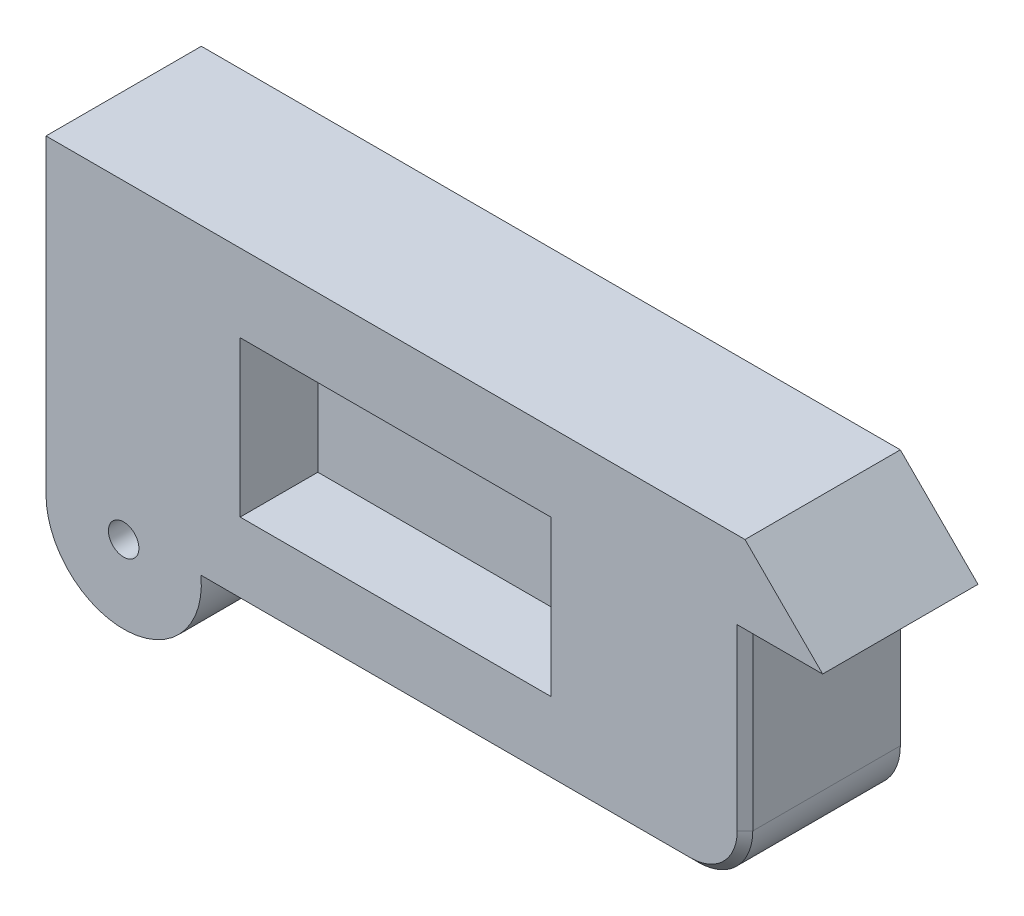
ISO-10303-21;
HEADER;
FILE_DESCRIPTION(('STEP AP214'),'2;1');
FILE_NAME('part.step','',(''),(''),'','','');
FILE_SCHEMA(('AUTOMOTIVE_DESIGN { 1 0 10303 214 1 1 1 1 }'));
ENDSEC;
DATA;
#1=APPLICATION_CONTEXT('core data for automotive mechanical design processes');
#2=APPLICATION_PROTOCOL_DEFINITION('international standard','automotive_design',2000,#1);
#3=PRODUCT_CONTEXT('',#1,'mechanical');
#4=PRODUCT('Part','Part','',(#3));
#5=PRODUCT_RELATED_PRODUCT_CATEGORY('part','',(#4));
#6=PRODUCT_DEFINITION_FORMATION('','',#4);
#7=PRODUCT_DEFINITION_CONTEXT('part definition',#1,'design');
#8=PRODUCT_DEFINITION('design','',#6,#7);
#9=PRODUCT_DEFINITION_SHAPE('','',#8);
#10=(LENGTH_UNIT() NAMED_UNIT(*) SI_UNIT(.MILLI.,.METRE.));
#11=(NAMED_UNIT(*) PLANE_ANGLE_UNIT() SI_UNIT($,.RADIAN.));
#12=(NAMED_UNIT(*) SI_UNIT($,.STERADIAN.) SOLID_ANGLE_UNIT());
#13=UNCERTAINTY_MEASURE_WITH_UNIT(LENGTH_MEASURE(1.E-05),#10,'distance_accuracy_value','');
#14=(GEOMETRIC_REPRESENTATION_CONTEXT(3) GLOBAL_UNCERTAINTY_ASSIGNED_CONTEXT((#13)) GLOBAL_UNIT_ASSIGNED_CONTEXT((#10,
#11,#12)) REPRESENTATION_CONTEXT('',''));
#15=CARTESIAN_POINT('',(0.,0.,0.));
#16=DIRECTION('',(0.,0.,1.));
#17=DIRECTION('',(1.,0.,0.));
#18=AXIS2_PLACEMENT_3D('',#15,#16,#17);
#19=CARTESIAN_POINT('',(254.,0.,508.));
#20=DIRECTION('',(0.,0.,-1.));
#21=DIRECTION('',(-1.,0.,0.));
#22=AXIS2_PLACEMENT_3D('',#19,#20,#21);
#23=CYLINDRICAL_SURFACE('',#22,254.);
#24=CARTESIAN_POINT('',(254.,0.,0.));
#25=DIRECTION('',(0.,0.,1.));
#26=DIRECTION('',(1.,0.,0.));
#27=AXIS2_PLACEMENT_3D('',#24,#25,#26);
#28=CIRCLE('',#27,254.);
#29=CARTESIAN_POINT('',(0.,0.,0.));
#30=VERTEX_POINT('',#29);
#31=CARTESIAN_POINT('',(508.,0.,0.));
#32=VERTEX_POINT('',#31);
#33=EDGE_CURVE('E198',#30,#32,#28,.T.);
#34=ORIENTED_EDGE('',*,*,#33,.T.);
#35=DIRECTION('',(0.,0.,-1.));
#36=VECTOR('',#35,1.);
#37=CARTESIAN_POINT('',(508.,0.,508.));
#38=LINE('',#37,#36);
#39=CARTESIAN_POINT('',(508.,0.,482.6));
#40=VERTEX_POINT('',#39);
#41=EDGE_CURVE('E239',#40,#32,#38,.T.);
#42=ORIENTED_EDGE('',*,*,#41,.F.);
#43=CARTESIAN_POINT('',(254.,0.,482.6));
#44=DIRECTION('',(0.,-0.707106781186548,0.707106781186548));
#45=DIRECTION('',(0.,-0.707106781186548,-0.707106781186548));
#46=AXIS2_PLACEMENT_3D('',#43,#44,#45);
#47=ELLIPSE('',#46,359.210244842766,254.);
#48=CARTESIAN_POINT('',(506.726809025081,25.3999999999999,508.));
#49=VERTEX_POINT('',#48);
#50=EDGE_CURVE('E11',#40,#49,#47,.T.);
#51=ORIENTED_EDGE('',*,*,#50,.T.);
#52=CARTESIAN_POINT('',(254.,0.,508.));
#53=DIRECTION('',(0.,0.,1.));
#54=DIRECTION('',(1.,0.,0.));
#55=AXIS2_PLACEMENT_3D('',#52,#53,#54);
#56=CIRCLE('',#55,254.);
#57=CARTESIAN_POINT('',(0.,0.,508.));
#58=VERTEX_POINT('',#57);
#59=EDGE_CURVE('E199',#58,#49,#56,.T.);
#60=ORIENTED_EDGE('',*,*,#59,.F.);
#61=DIRECTION('',(0.,0.,-1.));
#62=VECTOR('',#61,1.);
#63=CARTESIAN_POINT('',(0.,0.,508.));
#64=LINE('',#63,#62);
#65=EDGE_CURVE('E210',#58,#30,#64,.T.);
#66=ORIENTED_EDGE('',*,*,#65,.T.);
#67=EDGE_LOOP('',(#34,#42,#51,#60,#66));
#68=FACE_BOUND('',#67,.T.);
#69=ADVANCED_FACE('F44',(#68),#23,.T.);
#70=CARTESIAN_POINT('',(508.,0.,508.));
#71=DIRECTION('',(0.,1.,0.));
#72=DIRECTION('',(0.,0.,1.));
#73=AXIS2_PLACEMENT_3D('',#70,#71,#72);
#74=PLANE('',#73);
#75=DIRECTION('',(0.,0.,-1.));
#76=VECTOR('',#75,1.);
#77=CARTESIAN_POINT('',(2108.2,0.,508.));
#78=LINE('',#77,#76);
#79=CARTESIAN_POINT('',(2108.2,0.,0.));
#80=VERTEX_POINT('',#79);
#81=CARTESIAN_POINT('',(2108.2,0.,482.6));
#82=VERTEX_POINT('',#81);
#83=EDGE_CURVE('E245',#80,#82,#78,.F.);
#84=ORIENTED_EDGE('',*,*,#83,.T.);
#85=DIRECTION('',(-1.,0.,0.));
#86=VECTOR('',#85,1.);
#87=CARTESIAN_POINT('',(508.,0.,482.6));
#88=LINE('',#87,#86);
#89=EDGE_CURVE('E62',#82,#40,#88,.T.);
#90=ORIENTED_EDGE('',*,*,#89,.T.);
#91=ORIENTED_EDGE('',*,*,#41,.T.);
#92=DIRECTION('',(1.,0.,0.));
#93=VECTOR('',#92,1.);
#94=CARTESIAN_POINT('',(508.,0.,0.));
#95=LINE('',#94,#93);
#96=EDGE_CURVE('E213',#32,#80,#95,.T.);
#97=ORIENTED_EDGE('',*,*,#96,.T.);
#98=EDGE_LOOP('',(#84,#90,#91,#97));
#99=FACE_BOUND('',#98,.T.);
#100=ADVANCED_FACE('F276',(#99),#74,.F.);
#101=CARTESIAN_POINT('',(2286.,0.,508.));
#102=DIRECTION('',(-1.,0.,0.));
#103=DIRECTION('',(0.,0.,1.));
#104=AXIS2_PLACEMENT_3D('',#101,#102,#103);
#105=PLANE('',#104);
#106=DIRECTION('',(0.,0.,-1.));
#107=VECTOR('',#106,1.);
#108=CARTESIAN_POINT('',(2286.,762.,508.));
#109=LINE('',#108,#107);
#110=CARTESIAN_POINT('',(2286.,762.,482.6));
#111=VERTEX_POINT('',#110);
#112=CARTESIAN_POINT('',(2286.,762.,0.));
#113=VERTEX_POINT('',#112);
#114=EDGE_CURVE('E237',#111,#113,#109,.T.);
#115=ORIENTED_EDGE('',*,*,#114,.F.);
#116=DIRECTION('',(0.,-1.,0.));
#117=VECTOR('',#116,1.);
#118=CARTESIAN_POINT('',(2286.,177.8,482.6));
#119=LINE('',#118,#117);
#120=CARTESIAN_POINT('',(2286.,177.8,482.6));
#121=VERTEX_POINT('',#120);
#122=EDGE_CURVE('E254',#111,#121,#119,.T.);
#123=ORIENTED_EDGE('',*,*,#122,.T.);
#124=DIRECTION('',(0.,0.,-1.));
#125=VECTOR('',#124,1.);
#126=CARTESIAN_POINT('',(2286.,177.8,508.));
#127=LINE('',#126,#125);
#128=CARTESIAN_POINT('',(2286.,177.8,0.));
#129=VERTEX_POINT('',#128);
#130=EDGE_CURVE('E241',#121,#129,#127,.T.);
#131=ORIENTED_EDGE('',*,*,#130,.T.);
#132=DIRECTION('',(0.,1.,0.));
#133=VECTOR('',#132,1.);
#134=CARTESIAN_POINT('',(2286.,0.,0.));
#135=LINE('',#134,#133);
#136=EDGE_CURVE('E216',#129,#113,#135,.T.);
#137=ORIENTED_EDGE('',*,*,#136,.T.);
#138=EDGE_LOOP('',(#115,#123,#131,#137));
#139=FACE_BOUND('',#138,.T.);
#140=ADVANCED_FACE('F286',(#139),#105,.F.);
#141=CARTESIAN_POINT('',(2286.,762.,508.));
#142=DIRECTION('',(0.,1.,0.));
#143=DIRECTION('',(0.,0.,1.));
#144=AXIS2_PLACEMENT_3D('',#141,#142,#143);
#145=PLANE('',#144);
#146=DIRECTION('',(1.,0.,0.));
#147=VECTOR('',#146,1.);
#148=CARTESIAN_POINT('',(2286.,762.,0.));
#149=LINE('',#148,#147);
#150=CARTESIAN_POINT('',(2540.,762.,0.));
#151=VERTEX_POINT('',#150);
#152=EDGE_CURVE('E219',#113,#151,#149,.T.);
#153=ORIENTED_EDGE('',*,*,#152,.T.);
#154=DIRECTION('',(0.,0.,-1.));
#155=VECTOR('',#154,1.);
#156=CARTESIAN_POINT('',(2540.,762.,508.));
#157=LINE('',#156,#155);
#158=CARTESIAN_POINT('',(2540.,762.,508.));
#159=VERTEX_POINT('',#158);
#160=EDGE_CURVE('E234',#159,#151,#157,.T.);
#161=ORIENTED_EDGE('',*,*,#160,.F.);
#162=DIRECTION('',(1.,0.,0.));
#163=VECTOR('',#162,1.);
#164=CARTESIAN_POINT('',(2286.,762.,508.));
#165=LINE('',#164,#163);
#166=CARTESIAN_POINT('',(2260.6,762.,508.));
#167=VERTEX_POINT('',#166);
#168=EDGE_CURVE('E201',#167,#159,#165,.T.);
#169=ORIENTED_EDGE('',*,*,#168,.F.);
#170=DIRECTION('',(0.707106781186548,0.,-0.707106781186548));
#171=VECTOR('',#170,1.);
#172=CARTESIAN_POINT('',(2273.3,762.,495.3));
#173=LINE('',#172,#171);
#174=EDGE_CURVE('E54',#167,#111,#173,.T.);
#175=ORIENTED_EDGE('',*,*,#174,.T.);
#176=ORIENTED_EDGE('',*,*,#114,.T.);
#177=EDGE_LOOP('',(#153,#161,#169,#175,#176));
#178=FACE_BOUND('',#177,.T.);
#179=ADVANCED_FACE('F307',(#178),#145,.F.);
#180=CARTESIAN_POINT('',(2540.,762.,508.));
#181=DIRECTION('',(-0.707106781186548,-0.707106781186548,0.));
#182=DIRECTION('',(0.707106781186548,-0.707106781186548,0.));
#183=AXIS2_PLACEMENT_3D('',#180,#181,#182);
#184=PLANE('',#183);
#185=DIRECTION('',(-0.707106781186548,0.707106781186548,0.));
#186=VECTOR('',#185,1.);
#187=CARTESIAN_POINT('',(2540.,762.,0.));
#188=LINE('',#187,#186);
#189=CARTESIAN_POINT('',(2286.,1016.,0.));
#190=VERTEX_POINT('',#189);
#191=EDGE_CURVE('E221',#151,#190,#188,.T.);
#192=ORIENTED_EDGE('',*,*,#191,.T.);
#193=DIRECTION('',(0.,0.,-1.));
#194=VECTOR('',#193,1.);
#195=CARTESIAN_POINT('',(2286.,1016.,508.));
#196=LINE('',#195,#194);
#197=CARTESIAN_POINT('',(2286.,1016.,508.));
#198=VERTEX_POINT('',#197);
#199=EDGE_CURVE('E231',#198,#190,#196,.T.);
#200=ORIENTED_EDGE('',*,*,#199,.F.);
#201=DIRECTION('',(-0.707106781186548,0.707106781186548,0.));
#202=VECTOR('',#201,1.);
#203=CARTESIAN_POINT('',(2540.,762.,508.));
#204=LINE('',#203,#202);
#205=EDGE_CURVE('E204',#159,#198,#204,.T.);
#206=ORIENTED_EDGE('',*,*,#205,.F.);
#207=ORIENTED_EDGE('',*,*,#160,.T.);
#208=EDGE_LOOP('',(#192,#200,#206,#207));
#209=FACE_BOUND('',#208,.T.);
#210=ADVANCED_FACE('F306',(#209),#184,.F.);
#211=CARTESIAN_POINT('',(0.,1016.,508.));
#212=DIRECTION('',(0.,-1.,0.));
#213=DIRECTION('',(0.,0.,-1.));
#214=AXIS2_PLACEMENT_3D('',#211,#212,#213);
#215=PLANE('',#214);
#216=DIRECTION('',(-1.,0.,0.));
#217=VECTOR('',#216,1.);
#218=CARTESIAN_POINT('',(0.,1016.,0.));
#219=LINE('',#218,#217);
#220=CARTESIAN_POINT('',(0.,1016.,0.));
#221=VERTEX_POINT('',#220);
#222=EDGE_CURVE('E223',#190,#221,#219,.T.);
#223=ORIENTED_EDGE('',*,*,#222,.T.);
#224=DIRECTION('',(0.,0.,-1.));
#225=VECTOR('',#224,1.);
#226=CARTESIAN_POINT('',(0.,1016.,508.));
#227=LINE('',#226,#225);
#228=CARTESIAN_POINT('',(0.,1016.,508.));
#229=VERTEX_POINT('',#228);
#230=EDGE_CURVE('E228',#229,#221,#227,.T.);
#231=ORIENTED_EDGE('',*,*,#230,.F.);
#232=DIRECTION('',(-1.,0.,0.));
#233=VECTOR('',#232,1.);
#234=CARTESIAN_POINT('',(0.,1016.,508.));
#235=LINE('',#234,#233);
#236=EDGE_CURVE('E206',#198,#229,#235,.T.);
#237=ORIENTED_EDGE('',*,*,#236,.F.);
#238=ORIENTED_EDGE('',*,*,#199,.T.);
#239=EDGE_LOOP('',(#223,#231,#237,#238));
#240=FACE_BOUND('',#239,.T.);
#241=ADVANCED_FACE('F302',(#240),#215,.F.);
#242=CARTESIAN_POINT('',(0.,0.,508.));
#243=DIRECTION('',(1.,0.,0.));
#244=DIRECTION('',(0.,0.,-1.));
#245=AXIS2_PLACEMENT_3D('',#242,#243,#244);
#246=PLANE('',#245);
#247=DIRECTION('',(0.,-1.,0.));
#248=VECTOR('',#247,1.);
#249=CARTESIAN_POINT('',(0.,0.,0.));
#250=LINE('',#249,#248);
#251=EDGE_CURVE('E202',#221,#30,#250,.T.);
#252=ORIENTED_EDGE('',*,*,#251,.T.);
#253=ORIENTED_EDGE('',*,*,#65,.F.);
#254=DIRECTION('',(0.,-1.,0.));
#255=VECTOR('',#254,1.);
#256=CARTESIAN_POINT('',(0.,0.,508.));
#257=LINE('',#256,#255);
#258=EDGE_CURVE('E208',#229,#58,#257,.T.);
#259=ORIENTED_EDGE('',*,*,#258,.F.);
#260=ORIENTED_EDGE('',*,*,#230,.T.);
#261=EDGE_LOOP('',(#252,#253,#259,#260));
#262=FACE_BOUND('',#261,.T.);
#263=ADVANCED_FACE('F298',(#262),#246,.F.);
#264=CARTESIAN_POINT('',(254.,0.,508.));
#265=DIRECTION('',(0.,0.,1.));
#266=DIRECTION('',(1.,0.,0.));
#267=AXIS2_PLACEMENT_3D('',#264,#265,#266);
#268=PLANE('',#267);
#269=DIRECTION('',(0.,-1.,0.));
#270=VECTOR('',#269,1.);
#271=CARTESIAN_POINT('',(635.,254.,508.));
#272=LINE('',#271,#270);
#273=CARTESIAN_POINT('',(635.,762.,508.));
#274=VERTEX_POINT('',#273);
#275=CARTESIAN_POINT('',(635.,254.,508.));
#276=VERTEX_POINT('',#275);
#277=EDGE_CURVE('E157',#274,#276,#272,.T.);
#278=ORIENTED_EDGE('',*,*,#277,.F.);
#279=DIRECTION('',(-1.,0.,0.));
#280=VECTOR('',#279,1.);
#281=CARTESIAN_POINT('',(635.,762.,508.));
#282=LINE('',#281,#280);
#283=CARTESIAN_POINT('',(1651.,762.,508.));
#284=VERTEX_POINT('',#283);
#285=EDGE_CURVE('E174',#284,#274,#282,.T.);
#286=ORIENTED_EDGE('',*,*,#285,.F.);
#287=DIRECTION('',(0.,1.,0.));
#288=VECTOR('',#287,1.);
#289=CARTESIAN_POINT('',(1651.,254.,508.));
#290=LINE('',#289,#288);
#291=CARTESIAN_POINT('',(1651.,254.,508.));
#292=VERTEX_POINT('',#291);
#293=EDGE_CURVE('E177',#292,#284,#290,.T.);
#294=ORIENTED_EDGE('',*,*,#293,.F.);
#295=DIRECTION('',(1.,0.,0.));
#296=VECTOR('',#295,1.);
#297=CARTESIAN_POINT('',(635.,254.,508.));
#298=LINE('',#297,#296);
#299=EDGE_CURVE('E183',#276,#292,#298,.T.);
#300=ORIENTED_EDGE('',*,*,#299,.F.);
#301=EDGE_LOOP('',(#278,#286,#294,#300));
#302=FACE_BOUND('',#301,.T.);
#303=CARTESIAN_POINT('',(254.,0.,508.));
#304=DIRECTION('',(0.,0.,1.));
#305=DIRECTION('',(1.,0.,0.));
#306=AXIS2_PLACEMENT_3D('',#303,#304,#305);
#307=CIRCLE('',#306,49.8284499999999);
#308=CARTESIAN_POINT('',(303.82845,0.,508.));
#309=VERTEX_POINT('',#308);
#310=EDGE_CURVE('E189',#309,#309,#307,.T.);
#311=ORIENTED_EDGE('',*,*,#310,.F.);
#312=EDGE_LOOP('',(#311));
#313=FACE_BOUND('',#312,.T.);
#314=DIRECTION('',(0.,1.,0.));
#315=VECTOR('',#314,1.);
#316=CARTESIAN_POINT('',(2260.6,762.,508.));
#317=LINE('',#316,#315);
#318=CARTESIAN_POINT('',(2260.6,177.8,508.));
#319=VERTEX_POINT('',#318);
#320=EDGE_CURVE('E251',#319,#167,#317,.T.);
#321=ORIENTED_EDGE('',*,*,#320,.T.);
#322=ORIENTED_EDGE('',*,*,#168,.T.);
#323=ORIENTED_EDGE('',*,*,#205,.T.);
#324=ORIENTED_EDGE('',*,*,#236,.T.);
#325=ORIENTED_EDGE('',*,*,#258,.T.);
#326=ORIENTED_EDGE('',*,*,#59,.T.);
#327=DIRECTION('',(1.,0.,0.));
#328=VECTOR('',#327,1.);
#329=CARTESIAN_POINT('',(2108.2,25.3999999999999,508.));
#330=LINE('',#329,#328);
#331=CARTESIAN_POINT('',(2108.2,25.3999999999999,508.));
#332=VERTEX_POINT('',#331);
#333=EDGE_CURVE('E247',#49,#332,#330,.T.);
#334=ORIENTED_EDGE('',*,*,#333,.T.);
#335=CARTESIAN_POINT('',(2108.2,177.8,508.));
#336=DIRECTION('',(0.,0.,1.));
#337=DIRECTION('',(1.,0.,0.));
#338=AXIS2_PLACEMENT_3D('',#335,#336,#337);
#339=CIRCLE('',#338,152.4);
#340=EDGE_CURVE('E249',#332,#319,#339,.T.);
#341=ORIENTED_EDGE('',*,*,#340,.T.);
#342=EDGE_LOOP('',(#321,#322,#323,#324,#325,#326,#334,#341));
#343=FACE_BOUND('',#342,.T.);
#344=ADVANCED_FACE('F291',(#302,#313,#343),#268,.T.);
#345=CARTESIAN_POINT('',(254.,0.,0.));
#346=DIRECTION('',(0.,0.,1.));
#347=DIRECTION('',(1.,0.,0.));
#348=AXIS2_PLACEMENT_3D('',#345,#346,#347);
#349=PLANE('',#348);
#350=CARTESIAN_POINT('',(254.,0.,0.));
#351=DIRECTION('',(0.,0.,1.));
#352=DIRECTION('',(1.,0.,0.));
#353=AXIS2_PLACEMENT_3D('',#350,#351,#352);
#354=CIRCLE('',#353,49.8284499999999);
#355=CARTESIAN_POINT('',(303.82845,0.,0.));
#356=VERTEX_POINT('',#355);
#357=EDGE_CURVE('E195',#356,#356,#354,.T.);
#358=ORIENTED_EDGE('',*,*,#357,.T.);
#359=EDGE_LOOP('',(#358));
#360=FACE_BOUND('',#359,.T.);
#361=ORIENTED_EDGE('',*,*,#136,.F.);
#362=CARTESIAN_POINT('',(2108.2,177.8,0.));
#363=DIRECTION('',(0.,0.,1.));
#364=DIRECTION('',(1.,0.,0.));
#365=AXIS2_PLACEMENT_3D('',#362,#363,#364);
#366=CIRCLE('',#365,177.8);
#367=EDGE_CURVE('E243',#129,#80,#366,.F.);
#368=ORIENTED_EDGE('',*,*,#367,.T.);
#369=ORIENTED_EDGE('',*,*,#96,.F.);
#370=ORIENTED_EDGE('',*,*,#33,.F.);
#371=ORIENTED_EDGE('',*,*,#251,.F.);
#372=ORIENTED_EDGE('',*,*,#222,.F.);
#373=ORIENTED_EDGE('',*,*,#191,.F.);
#374=ORIENTED_EDGE('',*,*,#152,.F.);
#375=EDGE_LOOP('',(#361,#368,#369,#370,#371,#372,#373,#374));
#376=FACE_BOUND('',#375,.T.);
#377=ADVANCED_FACE('F279',(#360,#376),#349,.F.);
#378=CARTESIAN_POINT('',(254.,0.,508.));
#379=DIRECTION('',(0.,0.,1.));
#380=DIRECTION('',(1.,0.,0.));
#381=AXIS2_PLACEMENT_3D('',#378,#379,#380);
#382=CYLINDRICAL_SURFACE('',#381,49.8284499999999);
#383=ORIENTED_EDGE('',*,*,#357,.F.);
#384=EDGE_LOOP('',(#383));
#385=FACE_BOUND('',#384,.T.);
#386=ORIENTED_EDGE('',*,*,#310,.T.);
#387=EDGE_LOOP('',(#386));
#388=FACE_BOUND('',#387,.T.);
#389=ADVANCED_FACE('F378',(#385,#388),#382,.F.);
#390=CARTESIAN_POINT('',(635.,254.,254.));
#391=DIRECTION('',(-1.,0.,0.));
#392=DIRECTION('',(0.,0.,1.));
#393=AXIS2_PLACEMENT_3D('',#390,#391,#392);
#394=PLANE('',#393);
#395=ORIENTED_EDGE('',*,*,#277,.T.);
#396=DIRECTION('',(0.,0.,1.));
#397=VECTOR('',#396,1.);
#398=CARTESIAN_POINT('',(635.,254.,254.));
#399=LINE('',#398,#397);
#400=CARTESIAN_POINT('',(635.,254.,254.));
#401=VERTEX_POINT('',#400);
#402=EDGE_CURVE('E150',#401,#276,#399,.T.);
#403=ORIENTED_EDGE('',*,*,#402,.F.);
#404=DIRECTION('',(0.,-1.,0.));
#405=VECTOR('',#404,1.);
#406=CARTESIAN_POINT('',(635.,254.,254.));
#407=LINE('',#406,#405);
#408=CARTESIAN_POINT('',(635.,762.,254.));
#409=VERTEX_POINT('',#408);
#410=EDGE_CURVE('E154',#409,#401,#407,.T.);
#411=ORIENTED_EDGE('',*,*,#410,.F.);
#412=DIRECTION('',(0.,0.,1.));
#413=VECTOR('',#412,1.);
#414=CARTESIAN_POINT('',(635.,762.,254.));
#415=LINE('',#414,#413);
#416=EDGE_CURVE('E187',#409,#274,#415,.T.);
#417=ORIENTED_EDGE('',*,*,#416,.T.);
#418=EDGE_LOOP('',(#395,#403,#411,#417));
#419=FACE_BOUND('',#418,.T.);
#420=ADVANCED_FACE('F152',(#419),#394,.F.);
#421=CARTESIAN_POINT('',(635.,762.,254.));
#422=DIRECTION('',(0.,1.,0.));
#423=DIRECTION('',(0.,0.,1.));
#424=AXIS2_PLACEMENT_3D('',#421,#422,#423);
#425=PLANE('',#424);
#426=ORIENTED_EDGE('',*,*,#285,.T.);
#427=ORIENTED_EDGE('',*,*,#416,.F.);
#428=DIRECTION('',(-1.,0.,0.));
#429=VECTOR('',#428,1.);
#430=CARTESIAN_POINT('',(635.,762.,254.));
#431=LINE('',#430,#429);
#432=CARTESIAN_POINT('',(1651.,762.,254.));
#433=VERTEX_POINT('',#432);
#434=EDGE_CURVE('E162',#433,#409,#431,.T.);
#435=ORIENTED_EDGE('',*,*,#434,.F.);
#436=DIRECTION('',(0.,0.,1.));
#437=VECTOR('',#436,1.);
#438=CARTESIAN_POINT('',(1651.,762.,254.));
#439=LINE('',#438,#437);
#440=EDGE_CURVE('E190',#433,#284,#439,.T.);
#441=ORIENTED_EDGE('',*,*,#440,.T.);
#442=EDGE_LOOP('',(#426,#427,#435,#441));
#443=FACE_BOUND('',#442,.T.);
#444=ADVANCED_FACE('F363',(#443),#425,.F.);
#445=CARTESIAN_POINT('',(1651.,254.,254.));
#446=DIRECTION('',(1.,0.,0.));
#447=DIRECTION('',(0.,0.,-1.));
#448=AXIS2_PLACEMENT_3D('',#445,#446,#447);
#449=PLANE('',#448);
#450=ORIENTED_EDGE('',*,*,#293,.T.);
#451=ORIENTED_EDGE('',*,*,#440,.F.);
#452=DIRECTION('',(0.,1.,0.));
#453=VECTOR('',#452,1.);
#454=CARTESIAN_POINT('',(1651.,254.,254.));
#455=LINE('',#454,#453);
#456=CARTESIAN_POINT('',(1651.,254.,254.));
#457=VERTEX_POINT('',#456);
#458=EDGE_CURVE('E170',#457,#433,#455,.T.);
#459=ORIENTED_EDGE('',*,*,#458,.F.);
#460=DIRECTION('',(0.,0.,1.));
#461=VECTOR('',#460,1.);
#462=CARTESIAN_POINT('',(1651.,254.,254.));
#463=LINE('',#462,#461);
#464=EDGE_CURVE('E161',#457,#292,#463,.T.);
#465=ORIENTED_EDGE('',*,*,#464,.T.);
#466=EDGE_LOOP('',(#450,#451,#459,#465));
#467=FACE_BOUND('',#466,.T.);
#468=ADVANCED_FACE('F356',(#467),#449,.F.);
#469=CARTESIAN_POINT('',(635.,254.,254.));
#470=DIRECTION('',(0.,-1.,0.));
#471=DIRECTION('',(0.,0.,-1.));
#472=AXIS2_PLACEMENT_3D('',#469,#470,#471);
#473=PLANE('',#472);
#474=ORIENTED_EDGE('',*,*,#299,.T.);
#475=ORIENTED_EDGE('',*,*,#464,.F.);
#476=DIRECTION('',(1.,0.,0.));
#477=VECTOR('',#476,1.);
#478=CARTESIAN_POINT('',(635.,254.,254.));
#479=LINE('',#478,#477);
#480=EDGE_CURVE('E165',#401,#457,#479,.T.);
#481=ORIENTED_EDGE('',*,*,#480,.F.);
#482=ORIENTED_EDGE('',*,*,#402,.T.);
#483=EDGE_LOOP('',(#474,#475,#481,#482));
#484=FACE_BOUND('',#483,.T.);
#485=ADVANCED_FACE('F166',(#484),#473,.F.);
#486=CARTESIAN_POINT('',(0.,0.,254.));
#487=DIRECTION('',(0.,0.,-1.));
#488=DIRECTION('',(-1.,0.,0.));
#489=AXIS2_PLACEMENT_3D('',#486,#487,#488);
#490=PLANE('',#489);
#491=ORIENTED_EDGE('',*,*,#410,.T.);
#492=ORIENTED_EDGE('',*,*,#480,.T.);
#493=ORIENTED_EDGE('',*,*,#458,.T.);
#494=ORIENTED_EDGE('',*,*,#434,.T.);
#495=EDGE_LOOP('',(#491,#492,#493,#494));
#496=FACE_BOUND('',#495,.T.);
#497=ADVANCED_FACE('F172',(#496),#490,.F.);
#498=CARTESIAN_POINT('',(2108.2,177.8,508.));
#499=DIRECTION('',(0.,0.,-1.));
#500=DIRECTION('',(-1.,0.,0.));
#501=AXIS2_PLACEMENT_3D('',#498,#499,#500);
#502=CYLINDRICAL_SURFACE('',#501,177.8);
#503=ORIENTED_EDGE('',*,*,#130,.F.);
#504=CARTESIAN_POINT('',(2108.2,177.8,482.6));
#505=DIRECTION('',(0.,0.,1.));
#506=DIRECTION('',(1.,0.,0.));
#507=AXIS2_PLACEMENT_3D('',#504,#505,#506);
#508=CIRCLE('',#507,177.8);
#509=EDGE_CURVE('E70',#121,#82,#508,.F.);
#510=ORIENTED_EDGE('',*,*,#509,.T.);
#511=ORIENTED_EDGE('',*,*,#83,.F.);
#512=ORIENTED_EDGE('',*,*,#367,.F.);
#513=EDGE_LOOP('',(#503,#510,#511,#512));
#514=FACE_BOUND('',#513,.T.);
#515=ADVANCED_FACE('F283',(#514),#502,.T.);
#516=CARTESIAN_POINT('',(254.,25.3999999999999,508.));
#517=DIRECTION('',(0.,-0.707106781186548,0.707106781186548));
#518=DIRECTION('',(-1.,0.,0.));
#519=AXIS2_PLACEMENT_3D('',#516,#517,#518);
#520=PLANE('',#519);
#521=ORIENTED_EDGE('',*,*,#50,.F.);
#522=ORIENTED_EDGE('',*,*,#89,.F.);
#523=DIRECTION('',(0.,-0.707106781186548,-0.707106781186548));
#524=VECTOR('',#523,1.);
#525=CARTESIAN_POINT('',(2108.2,25.3999999999999,508.));
#526=LINE('',#525,#524);
#527=EDGE_CURVE('E49',#332,#82,#526,.T.);
#528=ORIENTED_EDGE('',*,*,#527,.F.);
#529=ORIENTED_EDGE('',*,*,#333,.F.);
#530=EDGE_LOOP('',(#521,#522,#528,#529));
#531=FACE_BOUND('',#530,.T.);
#532=ADVANCED_FACE('F47',(#531),#520,.T.);
#533=CARTESIAN_POINT('',(2108.2,177.8,508.));
#534=DIRECTION('',(0.,0.,-1.));
#535=DIRECTION('',(-1.,0.,0.));
#536=AXIS2_PLACEMENT_3D('',#533,#534,#535);
#537=CONICAL_SURFACE('',#536,152.4,0.785398163397448);
#538=ORIENTED_EDGE('',*,*,#527,.T.);
#539=ORIENTED_EDGE('',*,*,#509,.F.);
#540=DIRECTION('',(0.707106781186548,0.,-0.707106781186548));
#541=VECTOR('',#540,1.);
#542=CARTESIAN_POINT('',(2260.6,177.8,508.));
#543=LINE('',#542,#541);
#544=EDGE_CURVE('E258',#319,#121,#543,.T.);
#545=ORIENTED_EDGE('',*,*,#544,.F.);
#546=ORIENTED_EDGE('',*,*,#340,.F.);
#547=EDGE_LOOP('',(#538,#539,#545,#546));
#548=FACE_BOUND('',#547,.T.);
#549=ADVANCED_FACE('F268',(#548),#537,.T.);
#550=CARTESIAN_POINT('',(2260.6,0.,508.));
#551=DIRECTION('',(0.707106781186548,0.,0.707106781186548));
#552=DIRECTION('',(0.,-1.,0.));
#553=AXIS2_PLACEMENT_3D('',#550,#551,#552);
#554=PLANE('',#553);
#555=ORIENTED_EDGE('',*,*,#544,.T.);
#556=ORIENTED_EDGE('',*,*,#122,.F.);
#557=ORIENTED_EDGE('',*,*,#174,.F.);
#558=ORIENTED_EDGE('',*,*,#320,.F.);
#559=EDGE_LOOP('',(#555,#556,#557,#558));
#560=FACE_BOUND('',#559,.T.);
#561=ADVANCED_FACE('F288',(#560),#554,.T.);
#562=CLOSED_SHELL('',(#69,#100,#140,#179,#210,#241,#263,#344,#377,#389,#420,#444,#468,#485,#497,
#515,#532,#549,#561));
#563=MANIFOLD_SOLID_BREP('B2',#562);
#564=ADVANCED_BREP_SHAPE_REPRESENTATION('',(#18,#563),#14);
#565=SHAPE_DEFINITION_REPRESENTATION(#9,#564);
ENDSEC;
END-ISO-10303-21;
